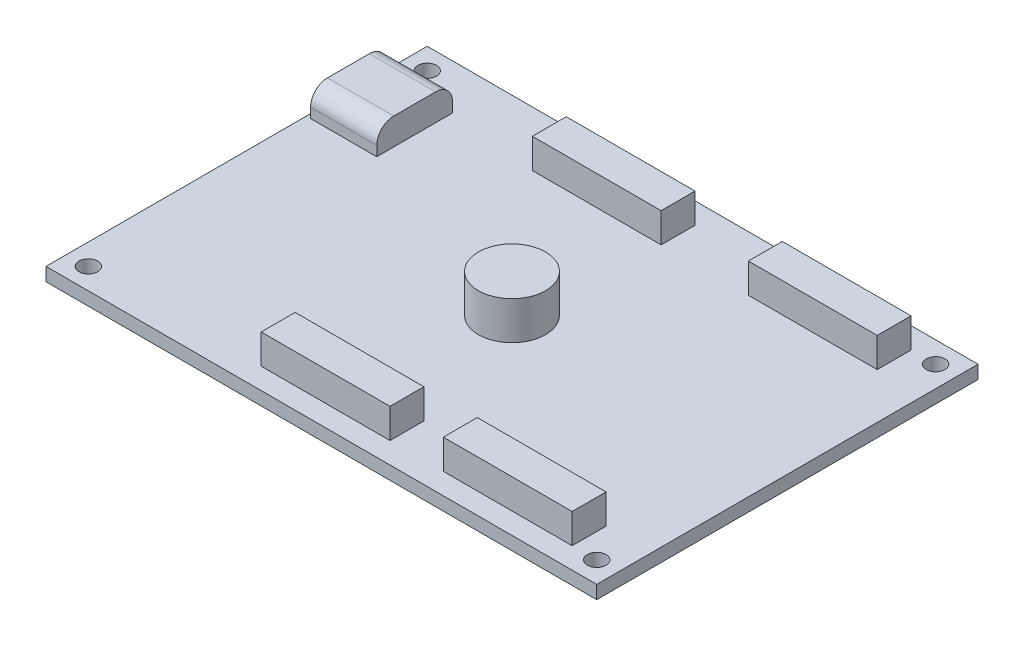
ISO-10303-21;
HEADER;
FILE_DESCRIPTION(('STEP AP214'),'2;1');
FILE_NAME('part.step','',(''),(''),'','','');
FILE_SCHEMA(('AUTOMOTIVE_DESIGN { 1 0 10303 214 1 1 1 1 }'));
ENDSEC;
DATA;
#1=APPLICATION_CONTEXT('core data for automotive mechanical design processes');
#2=APPLICATION_PROTOCOL_DEFINITION('international standard','automotive_design',2000,#1);
#3=PRODUCT_CONTEXT('',#1,'mechanical');
#4=PRODUCT('Part','Part','',(#3));
#5=PRODUCT_RELATED_PRODUCT_CATEGORY('part','',(#4));
#6=PRODUCT_DEFINITION_FORMATION('','',#4);
#7=PRODUCT_DEFINITION_CONTEXT('part definition',#1,'design');
#8=PRODUCT_DEFINITION('design','',#6,#7);
#9=PRODUCT_DEFINITION_SHAPE('','',#8);
#10=(LENGTH_UNIT() NAMED_UNIT(*) SI_UNIT(.MILLI.,.METRE.));
#11=(NAMED_UNIT(*) PLANE_ANGLE_UNIT() SI_UNIT($,.RADIAN.));
#12=(NAMED_UNIT(*) SI_UNIT($,.STERADIAN.) SOLID_ANGLE_UNIT());
#13=UNCERTAINTY_MEASURE_WITH_UNIT(LENGTH_MEASURE(1.E-05),#10,'distance_accuracy_value','');
#14=(GEOMETRIC_REPRESENTATION_CONTEXT(3) GLOBAL_UNCERTAINTY_ASSIGNED_CONTEXT((#13)) GLOBAL_UNIT_ASSIGNED_CONTEXT((#10,
#11,#12)) REPRESENTATION_CONTEXT('',''));
#15=CARTESIAN_POINT('',(0.,0.,0.));
#16=DIRECTION('',(0.,0.,1.));
#17=DIRECTION('',(1.,0.,0.));
#18=AXIS2_PLACEMENT_3D('',#15,#16,#17);
#19=CARTESIAN_POINT('',(0.,0.,0.));
#20=DIRECTION('',(0.,1.,0.));
#21=DIRECTION('',(0.,0.,1.));
#22=AXIS2_PLACEMENT_3D('',#19,#20,#21);
#23=PLANE('',#22);
#24=CARTESIAN_POINT('',(0.,0.,0.));
#25=DIRECTION('',(0.,1.,0.));
#26=DIRECTION('',(0.,0.,1.));
#27=AXIS2_PLACEMENT_3D('',#24,#25,#26);
#28=CIRCLE('',#27,3.96204769980138);
#29=CARTESIAN_POINT('',(0.,0.,3.96204769980138));
#30=VERTEX_POINT('',#29);
#31=EDGE_CURVE('E443',#30,#30,#28,.T.);
#32=ORIENTED_EDGE('',*,*,#31,.F.);
#33=EDGE_LOOP('',(#32));
#34=FACE_BOUND('',#33,.T.);
#35=DIRECTION('',(0.,0.,1.));
#36=VECTOR('',#35,1.);
#37=CARTESIAN_POINT('',(27.1,0.,0.));
#38=LINE('',#37,#36);
#39=CARTESIAN_POINT('',(27.1,0.,16.));
#40=VERTEX_POINT('',#39);
#41=CARTESIAN_POINT('',(27.1,0.,20.));
#42=VERTEX_POINT('',#41);
#43=EDGE_CURVE('E271',#40,#42,#38,.T.);
#44=ORIENTED_EDGE('',*,*,#43,.T.);
#45=DIRECTION('',(1.,0.,0.));
#46=VECTOR('',#45,1.);
#47=CARTESIAN_POINT('',(0.,0.,20.));
#48=LINE('',#47,#46);
#49=CARTESIAN_POINT('',(11.9,0.,20.));
#50=VERTEX_POINT('',#49);
#51=EDGE_CURVE('E276',#50,#42,#48,.T.);
#52=ORIENTED_EDGE('',*,*,#51,.F.);
#53=DIRECTION('',(0.,0.,1.));
#54=VECTOR('',#53,1.);
#55=CARTESIAN_POINT('',(11.9,0.,0.));
#56=LINE('',#55,#54);
#57=CARTESIAN_POINT('',(11.9,0.,16.));
#58=VERTEX_POINT('',#57);
#59=EDGE_CURVE('E289',#58,#50,#56,.T.);
#60=ORIENTED_EDGE('',*,*,#59,.F.);
#61=DIRECTION('',(1.,0.,0.));
#62=VECTOR('',#61,1.);
#63=CARTESIAN_POINT('',(0.,0.,16.));
#64=LINE('',#63,#62);
#65=EDGE_CURVE('E286',#58,#40,#64,.T.);
#66=ORIENTED_EDGE('',*,*,#65,.T.);
#67=EDGE_LOOP('',(#44,#52,#60,#66));
#68=FACE_BOUND('',#67,.T.);
#69=DIRECTION('',(0.,0.,1.));
#70=VECTOR('',#69,1.);
#71=CARTESIAN_POINT('',(27.1,0.,0.));
#72=LINE('',#71,#70);
#73=CARTESIAN_POINT('',(27.1,0.,-20.));
#74=VERTEX_POINT('',#73);
#75=CARTESIAN_POINT('',(27.1,0.,-16.));
#76=VERTEX_POINT('',#75);
#77=EDGE_CURVE('E301',#74,#76,#72,.T.);
#78=ORIENTED_EDGE('',*,*,#77,.T.);
#79=DIRECTION('',(1.,0.,0.));
#80=VECTOR('',#79,1.);
#81=CARTESIAN_POINT('',(0.,0.,-16.));
#82=LINE('',#81,#80);
#83=CARTESIAN_POINT('',(11.9,0.,-16.));
#84=VERTEX_POINT('',#83);
#85=EDGE_CURVE('E306',#84,#76,#82,.T.);
#86=ORIENTED_EDGE('',*,*,#85,.F.);
#87=DIRECTION('',(0.,0.,1.));
#88=VECTOR('',#87,1.);
#89=CARTESIAN_POINT('',(11.9,0.,0.));
#90=LINE('',#89,#88);
#91=CARTESIAN_POINT('',(11.9,0.,-20.));
#92=VERTEX_POINT('',#91);
#93=EDGE_CURVE('E319',#92,#84,#90,.T.);
#94=ORIENTED_EDGE('',*,*,#93,.F.);
#95=DIRECTION('',(1.,0.,0.));
#96=VECTOR('',#95,1.);
#97=CARTESIAN_POINT('',(0.,0.,-20.));
#98=LINE('',#97,#96);
#99=EDGE_CURVE('E316',#92,#74,#98,.T.);
#100=ORIENTED_EDGE('',*,*,#99,.T.);
#101=EDGE_LOOP('',(#78,#86,#94,#100));
#102=FACE_BOUND('',#101,.T.);
#103=DIRECTION('',(0.,0.,1.));
#104=VECTOR('',#103,1.);
#105=CARTESIAN_POINT('',(1.60000000000001,0.,0.));
#106=LINE('',#105,#104);
#107=CARTESIAN_POINT('',(1.60000000000001,0.,-20.));
#108=VERTEX_POINT('',#107);
#109=CARTESIAN_POINT('',(1.60000000000001,0.,-16.));
#110=VERTEX_POINT('',#109);
#111=EDGE_CURVE('E331',#108,#110,#106,.T.);
#112=ORIENTED_EDGE('',*,*,#111,.T.);
#113=DIRECTION('',(1.,0.,0.));
#114=VECTOR('',#113,1.);
#115=CARTESIAN_POINT('',(0.,0.,-16.));
#116=LINE('',#115,#114);
#117=CARTESIAN_POINT('',(-13.6,0.,-16.));
#118=VERTEX_POINT('',#117);
#119=EDGE_CURVE('E336',#118,#110,#116,.T.);
#120=ORIENTED_EDGE('',*,*,#119,.F.);
#121=DIRECTION('',(0.,0.,1.));
#122=VECTOR('',#121,1.);
#123=CARTESIAN_POINT('',(-13.6,0.,0.));
#124=LINE('',#123,#122);
#125=CARTESIAN_POINT('',(-13.6,0.,-20.));
#126=VERTEX_POINT('',#125);
#127=EDGE_CURVE('E349',#126,#118,#124,.T.);
#128=ORIENTED_EDGE('',*,*,#127,.F.);
#129=DIRECTION('',(1.,0.,0.));
#130=VECTOR('',#129,1.);
#131=CARTESIAN_POINT('',(0.,0.,-20.));
#132=LINE('',#131,#130);
#133=EDGE_CURVE('E346',#126,#108,#132,.T.);
#134=ORIENTED_EDGE('',*,*,#133,.T.);
#135=EDGE_LOOP('',(#112,#120,#128,#134));
#136=FACE_BOUND('',#135,.T.);
#137=DIRECTION('',(0.,0.,1.));
#138=VECTOR('',#137,1.);
#139=CARTESIAN_POINT('',(5.6,0.,0.));
#140=LINE('',#139,#138);
#141=CARTESIAN_POINT('',(5.60000000000001,0.,16.));
#142=VERTEX_POINT('',#141);
#143=CARTESIAN_POINT('',(5.60000000000002,0.,20.));
#144=VERTEX_POINT('',#143);
#145=EDGE_CURVE('E361',#142,#144,#140,.T.);
#146=ORIENTED_EDGE('',*,*,#145,.T.);
#147=DIRECTION('',(1.,0.,0.));
#148=VECTOR('',#147,1.);
#149=CARTESIAN_POINT('',(0.,0.,20.));
#150=LINE('',#149,#148);
#151=CARTESIAN_POINT('',(-9.59999999999998,0.,20.0000000000001));
#152=VERTEX_POINT('',#151);
#153=EDGE_CURVE('E366',#152,#144,#150,.T.);
#154=ORIENTED_EDGE('',*,*,#153,.F.);
#155=DIRECTION('',(0.,0.,1.));
#156=VECTOR('',#155,1.);
#157=CARTESIAN_POINT('',(-9.6,0.,0.));
#158=LINE('',#157,#156);
#159=CARTESIAN_POINT('',(-9.59999999999998,0.,16.));
#160=VERTEX_POINT('',#159);
#161=EDGE_CURVE('E379',#160,#152,#158,.T.);
#162=ORIENTED_EDGE('',*,*,#161,.F.);
#163=DIRECTION('',(1.,0.,0.));
#164=VECTOR('',#163,1.);
#165=CARTESIAN_POINT('',(0.,0.,16.));
#166=LINE('',#165,#164);
#167=EDGE_CURVE('E376',#160,#142,#166,.T.);
#168=ORIENTED_EDGE('',*,*,#167,.T.);
#169=EDGE_LOOP('',(#146,#154,#162,#168));
#170=FACE_BOUND('',#169,.T.);
#171=CARTESIAN_POINT('',(30.,0.,20.));
#172=DIRECTION('',(0.,1.,0.));
#173=DIRECTION('',(0.,0.,1.));
#174=AXIS2_PLACEMENT_3D('',#171,#172,#173);
#175=CIRCLE('',#174,1.1);
#176=CARTESIAN_POINT('',(30.,0.,21.1));
#177=VERTEX_POINT('',#176);
#178=EDGE_CURVE('E391',#177,#177,#175,.T.);
#179=ORIENTED_EDGE('',*,*,#178,.F.);
#180=EDGE_LOOP('',(#179));
#181=FACE_BOUND('',#180,.T.);
#182=CARTESIAN_POINT('',(30.,0.,-20.));
#183=DIRECTION('',(0.,1.,0.));
#184=DIRECTION('',(0.,0.,1.));
#185=AXIS2_PLACEMENT_3D('',#182,#183,#184);
#186=CIRCLE('',#185,1.1);
#187=CARTESIAN_POINT('',(30.,0.,-18.9));
#188=VERTEX_POINT('',#187);
#189=EDGE_CURVE('E420',#188,#188,#186,.T.);
#190=ORIENTED_EDGE('',*,*,#189,.F.);
#191=EDGE_LOOP('',(#190));
#192=FACE_BOUND('',#191,.T.);
#193=CARTESIAN_POINT('',(-30.,0.,-20.));
#194=DIRECTION('',(0.,1.,0.));
#195=DIRECTION('',(0.,0.,1.));
#196=AXIS2_PLACEMENT_3D('',#193,#194,#195);
#197=CIRCLE('',#196,1.1);
#198=CARTESIAN_POINT('',(-30.,0.,-18.9));
#199=VERTEX_POINT('',#198);
#200=EDGE_CURVE('E423',#199,#199,#197,.T.);
#201=ORIENTED_EDGE('',*,*,#200,.F.);
#202=EDGE_LOOP('',(#201));
#203=FACE_BOUND('',#202,.T.);
#204=CARTESIAN_POINT('',(-30.,0.,20.));
#205=DIRECTION('',(0.,1.,0.));
#206=DIRECTION('',(0.,0.,1.));
#207=AXIS2_PLACEMENT_3D('',#204,#205,#206);
#208=CIRCLE('',#207,1.1);
#209=CARTESIAN_POINT('',(-30.,0.,21.1));
#210=VERTEX_POINT('',#209);
#211=EDGE_CURVE('E426',#210,#210,#208,.T.);
#212=ORIENTED_EDGE('',*,*,#211,.F.);
#213=EDGE_LOOP('',(#212));
#214=FACE_BOUND('',#213,.T.);
#215=DIRECTION('',(0.,0.,-1.));
#216=VECTOR('',#215,1.);
#217=CARTESIAN_POINT('',(-32.5,0.,0.));
#218=LINE('',#217,#216);
#219=CARTESIAN_POINT('',(-32.5,0.,22.5));
#220=VERTEX_POINT('',#219);
#221=CARTESIAN_POINT('',(-32.5,0.,-22.5));
#222=VERTEX_POINT('',#221);
#223=EDGE_CURVE('E429',#220,#222,#218,.T.);
#224=ORIENTED_EDGE('',*,*,#223,.F.);
#225=DIRECTION('',(-1.,0.,0.));
#226=VECTOR('',#225,1.);
#227=CARTESIAN_POINT('',(0.,0.,22.5));
#228=LINE('',#227,#226);
#229=CARTESIAN_POINT('',(32.5,0.,22.5));
#230=VERTEX_POINT('',#229);
#231=EDGE_CURVE('E433',#230,#220,#228,.T.);
#232=ORIENTED_EDGE('',*,*,#231,.F.);
#233=DIRECTION('',(0.,0.,-1.));
#234=VECTOR('',#233,1.);
#235=CARTESIAN_POINT('',(32.5,0.,0.));
#236=LINE('',#235,#234);
#237=CARTESIAN_POINT('',(32.5,0.,-22.5));
#238=VERTEX_POINT('',#237);
#239=EDGE_CURVE('E435',#230,#238,#236,.T.);
#240=ORIENTED_EDGE('',*,*,#239,.T.);
#241=DIRECTION('',(-1.,0.,0.));
#242=VECTOR('',#241,1.);
#243=CARTESIAN_POINT('',(0.,0.,-22.5));
#244=LINE('',#243,#242);
#245=EDGE_CURVE('E396',#238,#222,#244,.T.);
#246=ORIENTED_EDGE('',*,*,#245,.T.);
#247=EDGE_LOOP('',(#224,#232,#240,#246));
#248=FACE_BOUND('',#247,.T.);
#249=DIRECTION('',(1.,0.,0.));
#250=VECTOR('',#249,1.);
#251=CARTESIAN_POINT('',(-32.,0.,-8.23000129));
#252=LINE('',#251,#250);
#253=CARTESIAN_POINT('',(-32.,0.,-8.23000129));
#254=VERTEX_POINT('',#253);
#255=CARTESIAN_POINT('',(-24.19,0.,-8.23000129));
#256=VERTEX_POINT('',#255);
#257=EDGE_CURVE('E225',#254,#256,#252,.T.);
#258=ORIENTED_EDGE('',*,*,#257,.F.);
#259=DIRECTION('',(0.,0.,1.));
#260=VECTOR('',#259,1.);
#261=CARTESIAN_POINT('',(-32.,0.,-17.17000129));
#262=LINE('',#261,#260);
#263=CARTESIAN_POINT('',(-32.,0.,-17.17000129));
#264=VERTEX_POINT('',#263);
#265=EDGE_CURVE('E235',#264,#254,#262,.T.);
#266=ORIENTED_EDGE('',*,*,#265,.F.);
#267=DIRECTION('',(-1.,0.,0.));
#268=VECTOR('',#267,1.);
#269=CARTESIAN_POINT('',(-32.,0.,-17.17000129));
#270=LINE('',#269,#268);
#271=CARTESIAN_POINT('',(-24.19,0.,-17.17000129));
#272=VERTEX_POINT('',#271);
#273=EDGE_CURVE('E249',#272,#264,#270,.T.);
#274=ORIENTED_EDGE('',*,*,#273,.F.);
#275=DIRECTION('',(0.,0.,-1.));
#276=VECTOR('',#275,1.);
#277=CARTESIAN_POINT('',(-24.19,0.,-17.17000129));
#278=LINE('',#277,#276);
#279=EDGE_CURVE('E245',#256,#272,#278,.T.);
#280=ORIENTED_EDGE('',*,*,#279,.F.);
#281=EDGE_LOOP('',(#258,#266,#274,#280));
#282=FACE_BOUND('',#281,.T.);
#283=ADVANCED_FACE('F41',(#34,#68,#102,#136,#170,#181,#192,#203,#214,#248,#282),#23,.T.);
#284=CARTESIAN_POINT('',(-32.5,-1.57,0.));
#285=DIRECTION('',(1.,0.,0.));
#286=DIRECTION('',(0.,0.,-1.));
#287=AXIS2_PLACEMENT_3D('',#284,#285,#286);
#288=PLANE('',#287);
#289=ORIENTED_EDGE('',*,*,#223,.T.);
#290=DIRECTION('',(0.,1.,0.));
#291=VECTOR('',#290,1.);
#292=CARTESIAN_POINT('',(-32.5,-1.57,-22.5));
#293=LINE('',#292,#291);
#294=CARTESIAN_POINT('',(-32.5,-1.57,-22.5));
#295=VERTEX_POINT('',#294);
#296=EDGE_CURVE('E441',#295,#222,#293,.T.);
#297=ORIENTED_EDGE('',*,*,#296,.F.);
#298=DIRECTION('',(0.,0.,-1.));
#299=VECTOR('',#298,1.);
#300=CARTESIAN_POINT('',(-32.5,-1.57,0.));
#301=LINE('',#300,#299);
#302=CARTESIAN_POINT('',(-32.5,-1.57,22.5));
#303=VERTEX_POINT('',#302);
#304=EDGE_CURVE('E405',#303,#295,#301,.T.);
#305=ORIENTED_EDGE('',*,*,#304,.F.);
#306=DIRECTION('',(0.,1.,0.));
#307=VECTOR('',#306,1.);
#308=CARTESIAN_POINT('',(-32.5,-1.57,22.5));
#309=LINE('',#308,#307);
#310=EDGE_CURVE('E417',#303,#220,#309,.T.);
#311=ORIENTED_EDGE('',*,*,#310,.T.);
#312=EDGE_LOOP('',(#289,#297,#305,#311));
#313=FACE_BOUND('',#312,.T.);
#314=ADVANCED_FACE('F485',(#313),#288,.F.);
#315=CARTESIAN_POINT('',(0.,-1.57,-22.5));
#316=DIRECTION('',(0.,0.,-1.));
#317=DIRECTION('',(-1.,0.,0.));
#318=AXIS2_PLACEMENT_3D('',#315,#316,#317);
#319=PLANE('',#318);
#320=ORIENTED_EDGE('',*,*,#245,.F.);
#321=DIRECTION('',(0.,1.,0.));
#322=VECTOR('',#321,1.);
#323=CARTESIAN_POINT('',(32.5,-1.57,-22.5));
#324=LINE('',#323,#322);
#325=CARTESIAN_POINT('',(32.5,-1.57,-22.5));
#326=VERTEX_POINT('',#325);
#327=EDGE_CURVE('E444',#326,#238,#324,.T.);
#328=ORIENTED_EDGE('',*,*,#327,.F.);
#329=DIRECTION('',(-1.,0.,0.));
#330=VECTOR('',#329,1.);
#331=CARTESIAN_POINT('',(0.,-1.57,-22.5));
#332=LINE('',#331,#330);
#333=EDGE_CURVE('E413',#326,#295,#332,.T.);
#334=ORIENTED_EDGE('',*,*,#333,.T.);
#335=ORIENTED_EDGE('',*,*,#296,.T.);
#336=EDGE_LOOP('',(#320,#328,#334,#335));
#337=FACE_BOUND('',#336,.T.);
#338=ADVANCED_FACE('F491',(#337),#319,.T.);
#339=CARTESIAN_POINT('',(32.5,-1.57,0.));
#340=DIRECTION('',(1.,0.,0.));
#341=DIRECTION('',(0.,0.,-1.));
#342=AXIS2_PLACEMENT_3D('',#339,#340,#341);
#343=PLANE('',#342);
#344=ORIENTED_EDGE('',*,*,#239,.F.);
#345=DIRECTION('',(0.,1.,0.));
#346=VECTOR('',#345,1.);
#347=CARTESIAN_POINT('',(32.5,-1.57,22.5));
#348=LINE('',#347,#346);
#349=CARTESIAN_POINT('',(32.5,-1.57,22.5));
#350=VERTEX_POINT('',#349);
#351=EDGE_CURVE('E446',#350,#230,#348,.T.);
#352=ORIENTED_EDGE('',*,*,#351,.F.);
#353=DIRECTION('',(0.,0.,-1.));
#354=VECTOR('',#353,1.);
#355=CARTESIAN_POINT('',(32.5,-1.57,0.));
#356=LINE('',#355,#354);
#357=EDGE_CURVE('E410',#350,#326,#356,.T.);
#358=ORIENTED_EDGE('',*,*,#357,.T.);
#359=ORIENTED_EDGE('',*,*,#327,.T.);
#360=EDGE_LOOP('',(#344,#352,#358,#359));
#361=FACE_BOUND('',#360,.T.);
#362=ADVANCED_FACE('F502',(#361),#343,.T.);
#363=CARTESIAN_POINT('',(-30.,-1.57,20.));
#364=DIRECTION('',(0.,1.,0.));
#365=DIRECTION('',(0.,0.,1.));
#366=AXIS2_PLACEMENT_3D('',#363,#364,#365);
#367=CYLINDRICAL_SURFACE('',#366,1.1);
#368=CARTESIAN_POINT('',(-30.,-1.57,20.));
#369=DIRECTION('',(0.,1.,0.));
#370=DIRECTION('',(0.,0.,1.));
#371=AXIS2_PLACEMENT_3D('',#368,#369,#370);
#372=CIRCLE('',#371,1.1);
#373=CARTESIAN_POINT('',(-30.,-1.57,21.1));
#374=VERTEX_POINT('',#373);
#375=EDGE_CURVE('E402',#374,#374,#372,.T.);
#376=ORIENTED_EDGE('',*,*,#375,.F.);
#377=EDGE_LOOP('',(#376));
#378=FACE_BOUND('',#377,.T.);
#379=ORIENTED_EDGE('',*,*,#211,.T.);
#380=EDGE_LOOP('',(#379));
#381=FACE_BOUND('',#380,.T.);
#382=ADVANCED_FACE('F506',(#378,#381),#367,.F.);
#383=CARTESIAN_POINT('',(-30.,-1.57,-20.));
#384=DIRECTION('',(0.,1.,0.));
#385=DIRECTION('',(0.,0.,1.));
#386=AXIS2_PLACEMENT_3D('',#383,#384,#385);
#387=CYLINDRICAL_SURFACE('',#386,1.1);
#388=CARTESIAN_POINT('',(-30.,-1.57,-20.));
#389=DIRECTION('',(0.,1.,0.));
#390=DIRECTION('',(0.,0.,1.));
#391=AXIS2_PLACEMENT_3D('',#388,#389,#390);
#392=CIRCLE('',#391,1.1);
#393=CARTESIAN_POINT('',(-30.,-1.57,-18.9));
#394=VERTEX_POINT('',#393);
#395=EDGE_CURVE('E399',#394,#394,#392,.T.);
#396=ORIENTED_EDGE('',*,*,#395,.F.);
#397=EDGE_LOOP('',(#396));
#398=FACE_BOUND('',#397,.T.);
#399=ORIENTED_EDGE('',*,*,#200,.T.);
#400=EDGE_LOOP('',(#399));
#401=FACE_BOUND('',#400,.T.);
#402=ADVANCED_FACE('F515',(#398,#401),#387,.F.);
#403=CARTESIAN_POINT('',(30.,-1.57,-20.));
#404=DIRECTION('',(0.,1.,0.));
#405=DIRECTION('',(0.,0.,1.));
#406=AXIS2_PLACEMENT_3D('',#403,#404,#405);
#407=CYLINDRICAL_SURFACE('',#406,1.1);
#408=CARTESIAN_POINT('',(30.,-1.57,-20.));
#409=DIRECTION('',(0.,1.,0.));
#410=DIRECTION('',(0.,0.,1.));
#411=AXIS2_PLACEMENT_3D('',#408,#409,#410);
#412=CIRCLE('',#411,1.1);
#413=CARTESIAN_POINT('',(30.,-1.57,-18.9));
#414=VERTEX_POINT('',#413);
#415=EDGE_CURVE('E395',#414,#414,#412,.T.);
#416=ORIENTED_EDGE('',*,*,#415,.F.);
#417=EDGE_LOOP('',(#416));
#418=FACE_BOUND('',#417,.T.);
#419=ORIENTED_EDGE('',*,*,#189,.T.);
#420=EDGE_LOOP('',(#419));
#421=FACE_BOUND('',#420,.T.);
#422=ADVANCED_FACE('F519',(#418,#421),#407,.F.);
#423=CARTESIAN_POINT('',(30.,-1.57,20.));
#424=DIRECTION('',(0.,1.,0.));
#425=DIRECTION('',(0.,0.,1.));
#426=AXIS2_PLACEMENT_3D('',#423,#424,#425);
#427=CYLINDRICAL_SURFACE('',#426,1.1);
#428=CARTESIAN_POINT('',(30.,-1.57,20.));
#429=DIRECTION('',(0.,1.,0.));
#430=DIRECTION('',(0.,0.,1.));
#431=AXIS2_PLACEMENT_3D('',#428,#429,#430);
#432=CIRCLE('',#431,1.1);
#433=CARTESIAN_POINT('',(30.,-1.57,21.1));
#434=VERTEX_POINT('',#433);
#435=EDGE_CURVE('E392',#434,#434,#432,.T.);
#436=ORIENTED_EDGE('',*,*,#435,.F.);
#437=EDGE_LOOP('',(#436));
#438=FACE_BOUND('',#437,.T.);
#439=ORIENTED_EDGE('',*,*,#178,.T.);
#440=EDGE_LOOP('',(#439));
#441=FACE_BOUND('',#440,.T.);
#442=ADVANCED_FACE('F510',(#438,#441),#427,.F.);
#443=CARTESIAN_POINT('',(0.,-1.57,22.5));
#444=DIRECTION('',(0.,0.,-1.));
#445=DIRECTION('',(-1.,0.,0.));
#446=AXIS2_PLACEMENT_3D('',#443,#444,#445);
#447=PLANE('',#446);
#448=ORIENTED_EDGE('',*,*,#231,.T.);
#449=ORIENTED_EDGE('',*,*,#310,.F.);
#450=DIRECTION('',(-1.,0.,0.));
#451=VECTOR('',#450,1.);
#452=CARTESIAN_POINT('',(0.,-1.57,22.5));
#453=LINE('',#452,#451);
#454=EDGE_CURVE('E408',#350,#303,#453,.T.);
#455=ORIENTED_EDGE('',*,*,#454,.F.);
#456=ORIENTED_EDGE('',*,*,#351,.T.);
#457=EDGE_LOOP('',(#448,#449,#455,#456));
#458=FACE_BOUND('',#457,.T.);
#459=ADVANCED_FACE('F508',(#458),#447,.F.);
#460=CARTESIAN_POINT('',(0.,-1.57,0.));
#461=DIRECTION('',(0.,1.,0.));
#462=DIRECTION('',(0.,0.,1.));
#463=AXIS2_PLACEMENT_3D('',#460,#461,#462);
#464=PLANE('',#463);
#465=CARTESIAN_POINT('',(0.,-1.57,0.));
#466=DIRECTION('',(0.,1.,0.));
#467=DIRECTION('',(0.,0.,1.));
#468=AXIS2_PLACEMENT_3D('',#465,#466,#467);
#469=CIRCLE('',#468,3.96204769980138);
#470=CARTESIAN_POINT('',(0.,-1.57,3.96204769980138));
#471=VERTEX_POINT('',#470);
#472=EDGE_CURVE('E268',#471,#471,#469,.T.);
#473=ORIENTED_EDGE('',*,*,#472,.T.);
#474=EDGE_LOOP('',(#473));
#475=FACE_BOUND('',#474,.T.);
#476=ORIENTED_EDGE('',*,*,#435,.T.);
#477=EDGE_LOOP('',(#476));
#478=FACE_BOUND('',#477,.T.);
#479=ORIENTED_EDGE('',*,*,#415,.T.);
#480=EDGE_LOOP('',(#479));
#481=FACE_BOUND('',#480,.T.);
#482=ORIENTED_EDGE('',*,*,#395,.T.);
#483=EDGE_LOOP('',(#482));
#484=FACE_BOUND('',#483,.T.);
#485=ORIENTED_EDGE('',*,*,#375,.T.);
#486=EDGE_LOOP('',(#485));
#487=FACE_BOUND('',#486,.T.);
#488=ORIENTED_EDGE('',*,*,#304,.T.);
#489=ORIENTED_EDGE('',*,*,#333,.F.);
#490=ORIENTED_EDGE('',*,*,#357,.F.);
#491=ORIENTED_EDGE('',*,*,#454,.T.);
#492=EDGE_LOOP('',(#488,#489,#490,#491));
#493=FACE_BOUND('',#492,.T.);
#494=ADVANCED_FACE('F498',(#475,#478,#481,#484,#487,#493),#464,.F.);
#495=CARTESIAN_POINT('',(5.6,3.5,0.));
#496=DIRECTION('',(1.,0.,0.));
#497=DIRECTION('',(0.,0.,-1.));
#498=AXIS2_PLACEMENT_3D('',#495,#496,#497);
#499=PLANE('',#498);
#500=ORIENTED_EDGE('',*,*,#145,.F.);
#501=DIRECTION('',(0.,-1.,0.));
#502=VECTOR('',#501,1.);
#503=CARTESIAN_POINT('',(5.60000000000001,3.5,16.));
#504=LINE('',#503,#502);
#505=CARTESIAN_POINT('',(5.60000000000001,3.5,16.));
#506=VERTEX_POINT('',#505);
#507=EDGE_CURVE('E389',#506,#142,#504,.T.);
#508=ORIENTED_EDGE('',*,*,#507,.F.);
#509=DIRECTION('',(0.,0.,1.));
#510=VECTOR('',#509,1.);
#511=CARTESIAN_POINT('',(5.6,3.5,0.));
#512=LINE('',#511,#510);
#513=CARTESIAN_POINT('',(5.60000000000002,3.5,20.));
#514=VERTEX_POINT('',#513);
#515=EDGE_CURVE('E362',#506,#514,#512,.T.);
#516=ORIENTED_EDGE('',*,*,#515,.T.);
#517=DIRECTION('',(0.,-1.,0.));
#518=VECTOR('',#517,1.);
#519=CARTESIAN_POINT('',(5.60000000000002,3.5,20.));
#520=LINE('',#519,#518);
#521=EDGE_CURVE('E373',#514,#144,#520,.T.);
#522=ORIENTED_EDGE('',*,*,#521,.T.);
#523=EDGE_LOOP('',(#500,#508,#516,#522));
#524=FACE_BOUND('',#523,.T.);
#525=ADVANCED_FACE('F551',(#524),#499,.T.);
#526=CARTESIAN_POINT('',(0.,3.5,16.));
#527=DIRECTION('',(0.,0.,-1.));
#528=DIRECTION('',(-1.,0.,0.));
#529=AXIS2_PLACEMENT_3D('',#526,#527,#528);
#530=PLANE('',#529);
#531=ORIENTED_EDGE('',*,*,#167,.F.);
#532=DIRECTION('',(0.,-1.,0.));
#533=VECTOR('',#532,1.);
#534=CARTESIAN_POINT('',(-9.59999999999998,3.5,16.));
#535=LINE('',#534,#533);
#536=CARTESIAN_POINT('',(-9.59999999999998,3.5,16.));
#537=VERTEX_POINT('',#536);
#538=EDGE_CURVE('E387',#537,#160,#535,.T.);
#539=ORIENTED_EDGE('',*,*,#538,.F.);
#540=DIRECTION('',(1.,0.,0.));
#541=VECTOR('',#540,1.);
#542=CARTESIAN_POINT('',(0.,3.5,16.));
#543=LINE('',#542,#541);
#544=EDGE_CURVE('E365',#537,#506,#543,.T.);
#545=ORIENTED_EDGE('',*,*,#544,.T.);
#546=ORIENTED_EDGE('',*,*,#507,.T.);
#547=EDGE_LOOP('',(#531,#539,#545,#546));
#548=FACE_BOUND('',#547,.T.);
#549=ADVANCED_FACE('F556',(#548),#530,.T.);
#550=CARTESIAN_POINT('',(-9.6,3.5,0.));
#551=DIRECTION('',(1.,0.,0.));
#552=DIRECTION('',(0.,0.,-1.));
#553=AXIS2_PLACEMENT_3D('',#550,#551,#552);
#554=PLANE('',#553);
#555=ORIENTED_EDGE('',*,*,#161,.T.);
#556=DIRECTION('',(0.,-1.,0.));
#557=VECTOR('',#556,1.);
#558=CARTESIAN_POINT('',(-9.59999999999998,3.5,20.0000000000001));
#559=LINE('',#558,#557);
#560=CARTESIAN_POINT('',(-9.59999999999998,3.5,20.0000000000001));
#561=VERTEX_POINT('',#560);
#562=EDGE_CURVE('E385',#561,#152,#559,.T.);
#563=ORIENTED_EDGE('',*,*,#562,.F.);
#564=DIRECTION('',(0.,0.,1.));
#565=VECTOR('',#564,1.);
#566=CARTESIAN_POINT('',(-9.6,3.5,0.));
#567=LINE('',#566,#565);
#568=EDGE_CURVE('E369',#537,#561,#567,.T.);
#569=ORIENTED_EDGE('',*,*,#568,.F.);
#570=ORIENTED_EDGE('',*,*,#538,.T.);
#571=EDGE_LOOP('',(#555,#563,#569,#570));
#572=FACE_BOUND('',#571,.T.);
#573=ADVANCED_FACE('F653',(#572),#554,.F.);
#574=CARTESIAN_POINT('',(0.,3.5,20.));
#575=DIRECTION('',(0.,0.,-1.));
#576=DIRECTION('',(-1.,0.,0.));
#577=AXIS2_PLACEMENT_3D('',#574,#575,#576);
#578=PLANE('',#577);
#579=ORIENTED_EDGE('',*,*,#153,.T.);
#580=ORIENTED_EDGE('',*,*,#521,.F.);
#581=DIRECTION('',(1.,0.,0.));
#582=VECTOR('',#581,1.);
#583=CARTESIAN_POINT('',(0.,3.5,20.));
#584=LINE('',#583,#582);
#585=EDGE_CURVE('E371',#561,#514,#584,.T.);
#586=ORIENTED_EDGE('',*,*,#585,.F.);
#587=ORIENTED_EDGE('',*,*,#562,.T.);
#588=EDGE_LOOP('',(#579,#580,#586,#587));
#589=FACE_BOUND('',#588,.T.);
#590=ADVANCED_FACE('F649',(#589),#578,.F.);
#591=CARTESIAN_POINT('',(0.,3.5,0.));
#592=DIRECTION('',(0.,1.,0.));
#593=DIRECTION('',(0.,0.,1.));
#594=AXIS2_PLACEMENT_3D('',#591,#592,#593);
#595=PLANE('',#594);
#596=ORIENTED_EDGE('',*,*,#515,.F.);
#597=ORIENTED_EDGE('',*,*,#544,.F.);
#598=ORIENTED_EDGE('',*,*,#568,.T.);
#599=ORIENTED_EDGE('',*,*,#585,.T.);
#600=EDGE_LOOP('',(#596,#597,#598,#599));
#601=FACE_BOUND('',#600,.T.);
#602=ADVANCED_FACE('F645',(#601),#595,.T.);
#603=CARTESIAN_POINT('',(1.60000000000001,3.5,0.));
#604=DIRECTION('',(1.,0.,0.));
#605=DIRECTION('',(0.,0.,-1.));
#606=AXIS2_PLACEMENT_3D('',#603,#604,#605);
#607=PLANE('',#606);
#608=ORIENTED_EDGE('',*,*,#111,.F.);
#609=DIRECTION('',(0.,-1.,0.));
#610=VECTOR('',#609,1.);
#611=CARTESIAN_POINT('',(1.60000000000001,3.5,-20.));
#612=LINE('',#611,#610);
#613=CARTESIAN_POINT('',(1.60000000000001,3.5,-20.));
#614=VERTEX_POINT('',#613);
#615=EDGE_CURVE('E359',#614,#108,#612,.T.);
#616=ORIENTED_EDGE('',*,*,#615,.F.);
#617=DIRECTION('',(0.,0.,1.));
#618=VECTOR('',#617,1.);
#619=CARTESIAN_POINT('',(1.60000000000001,3.5,0.));
#620=LINE('',#619,#618);
#621=CARTESIAN_POINT('',(1.60000000000001,3.5,-16.));
#622=VERTEX_POINT('',#621);
#623=EDGE_CURVE('E332',#614,#622,#620,.T.);
#624=ORIENTED_EDGE('',*,*,#623,.T.);
#625=DIRECTION('',(0.,-1.,0.));
#626=VECTOR('',#625,1.);
#627=CARTESIAN_POINT('',(1.60000000000001,3.5,-16.));
#628=LINE('',#627,#626);
#629=EDGE_CURVE('E343',#622,#110,#628,.T.);
#630=ORIENTED_EDGE('',*,*,#629,.T.);
#631=EDGE_LOOP('',(#608,#616,#624,#630));
#632=FACE_BOUND('',#631,.T.);
#633=ADVANCED_FACE('F641',(#632),#607,.T.);
#634=CARTESIAN_POINT('',(0.,3.5,-20.));
#635=DIRECTION('',(0.,0.,-1.));
#636=DIRECTION('',(-1.,0.,0.));
#637=AXIS2_PLACEMENT_3D('',#634,#635,#636);
#638=PLANE('',#637);
#639=ORIENTED_EDGE('',*,*,#133,.F.);
#640=DIRECTION('',(0.,-1.,0.));
#641=VECTOR('',#640,1.);
#642=CARTESIAN_POINT('',(-13.6,3.5,-20.));
#643=LINE('',#642,#641);
#644=CARTESIAN_POINT('',(-13.6,3.5,-20.));
#645=VERTEX_POINT('',#644);
#646=EDGE_CURVE('E357',#645,#126,#643,.T.);
#647=ORIENTED_EDGE('',*,*,#646,.F.);
#648=DIRECTION('',(1.,0.,0.));
#649=VECTOR('',#648,1.);
#650=CARTESIAN_POINT('',(0.,3.5,-20.));
#651=LINE('',#650,#649);
#652=EDGE_CURVE('E335',#645,#614,#651,.T.);
#653=ORIENTED_EDGE('',*,*,#652,.T.);
#654=ORIENTED_EDGE('',*,*,#615,.T.);
#655=EDGE_LOOP('',(#639,#647,#653,#654));
#656=FACE_BOUND('',#655,.T.);
#657=ADVANCED_FACE('F637',(#656),#638,.T.);
#658=CARTESIAN_POINT('',(-13.6,3.5,0.));
#659=DIRECTION('',(1.,0.,0.));
#660=DIRECTION('',(0.,0.,-1.));
#661=AXIS2_PLACEMENT_3D('',#658,#659,#660);
#662=PLANE('',#661);
#663=ORIENTED_EDGE('',*,*,#127,.T.);
#664=DIRECTION('',(0.,-1.,0.));
#665=VECTOR('',#664,1.);
#666=CARTESIAN_POINT('',(-13.6,3.5,-16.));
#667=LINE('',#666,#665);
#668=CARTESIAN_POINT('',(-13.6,3.5,-16.));
#669=VERTEX_POINT('',#668);
#670=EDGE_CURVE('E355',#669,#118,#667,.T.);
#671=ORIENTED_EDGE('',*,*,#670,.F.);
#672=DIRECTION('',(0.,0.,1.));
#673=VECTOR('',#672,1.);
#674=CARTESIAN_POINT('',(-13.6,3.5,0.));
#675=LINE('',#674,#673);
#676=EDGE_CURVE('E339',#645,#669,#675,.T.);
#677=ORIENTED_EDGE('',*,*,#676,.F.);
#678=ORIENTED_EDGE('',*,*,#646,.T.);
#679=EDGE_LOOP('',(#663,#671,#677,#678));
#680=FACE_BOUND('',#679,.T.);
#681=ADVANCED_FACE('F633',(#680),#662,.F.);
#682=CARTESIAN_POINT('',(0.,3.5,-16.));
#683=DIRECTION('',(0.,0.,-1.));
#684=DIRECTION('',(-1.,0.,0.));
#685=AXIS2_PLACEMENT_3D('',#682,#683,#684);
#686=PLANE('',#685);
#687=ORIENTED_EDGE('',*,*,#119,.T.);
#688=ORIENTED_EDGE('',*,*,#629,.F.);
#689=DIRECTION('',(1.,0.,0.));
#690=VECTOR('',#689,1.);
#691=CARTESIAN_POINT('',(0.,3.5,-16.));
#692=LINE('',#691,#690);
#693=EDGE_CURVE('E341',#669,#622,#692,.T.);
#694=ORIENTED_EDGE('',*,*,#693,.F.);
#695=ORIENTED_EDGE('',*,*,#670,.T.);
#696=EDGE_LOOP('',(#687,#688,#694,#695));
#697=FACE_BOUND('',#696,.T.);
#698=ADVANCED_FACE('F629',(#697),#686,.F.);
#699=CARTESIAN_POINT('',(0.,3.5,0.));
#700=DIRECTION('',(0.,1.,0.));
#701=DIRECTION('',(0.,0.,1.));
#702=AXIS2_PLACEMENT_3D('',#699,#700,#701);
#703=PLANE('',#702);
#704=ORIENTED_EDGE('',*,*,#623,.F.);
#705=ORIENTED_EDGE('',*,*,#652,.F.);
#706=ORIENTED_EDGE('',*,*,#676,.T.);
#707=ORIENTED_EDGE('',*,*,#693,.T.);
#708=EDGE_LOOP('',(#704,#705,#706,#707));
#709=FACE_BOUND('',#708,.T.);
#710=ADVANCED_FACE('F625',(#709),#703,.T.);
#711=CARTESIAN_POINT('',(27.1,3.5,0.));
#712=DIRECTION('',(1.,0.,0.));
#713=DIRECTION('',(0.,0.,-1.));
#714=AXIS2_PLACEMENT_3D('',#711,#712,#713);
#715=PLANE('',#714);
#716=ORIENTED_EDGE('',*,*,#77,.F.);
#717=DIRECTION('',(0.,-1.,0.));
#718=VECTOR('',#717,1.);
#719=CARTESIAN_POINT('',(27.1,3.5,-20.));
#720=LINE('',#719,#718);
#721=CARTESIAN_POINT('',(27.1,3.5,-20.));
#722=VERTEX_POINT('',#721);
#723=EDGE_CURVE('E329',#722,#74,#720,.T.);
#724=ORIENTED_EDGE('',*,*,#723,.F.);
#725=DIRECTION('',(0.,0.,1.));
#726=VECTOR('',#725,1.);
#727=CARTESIAN_POINT('',(27.1,3.5,0.));
#728=LINE('',#727,#726);
#729=CARTESIAN_POINT('',(27.1,3.5,-16.));
#730=VERTEX_POINT('',#729);
#731=EDGE_CURVE('E302',#722,#730,#728,.T.);
#732=ORIENTED_EDGE('',*,*,#731,.T.);
#733=DIRECTION('',(0.,-1.,0.));
#734=VECTOR('',#733,1.);
#735=CARTESIAN_POINT('',(27.1,3.5,-16.));
#736=LINE('',#735,#734);
#737=EDGE_CURVE('E313',#730,#76,#736,.T.);
#738=ORIENTED_EDGE('',*,*,#737,.T.);
#739=EDGE_LOOP('',(#716,#724,#732,#738));
#740=FACE_BOUND('',#739,.T.);
#741=ADVANCED_FACE('F621',(#740),#715,.T.);
#742=CARTESIAN_POINT('',(0.,3.5,-20.));
#743=DIRECTION('',(0.,0.,-1.));
#744=DIRECTION('',(-1.,0.,0.));
#745=AXIS2_PLACEMENT_3D('',#742,#743,#744);
#746=PLANE('',#745);
#747=ORIENTED_EDGE('',*,*,#99,.F.);
#748=DIRECTION('',(0.,-1.,0.));
#749=VECTOR('',#748,1.);
#750=CARTESIAN_POINT('',(11.9,3.5,-20.));
#751=LINE('',#750,#749);
#752=CARTESIAN_POINT('',(11.9,3.5,-20.));
#753=VERTEX_POINT('',#752);
#754=EDGE_CURVE('E327',#753,#92,#751,.T.);
#755=ORIENTED_EDGE('',*,*,#754,.F.);
#756=DIRECTION('',(1.,0.,0.));
#757=VECTOR('',#756,1.);
#758=CARTESIAN_POINT('',(0.,3.5,-20.));
#759=LINE('',#758,#757);
#760=EDGE_CURVE('E305',#753,#722,#759,.T.);
#761=ORIENTED_EDGE('',*,*,#760,.T.);
#762=ORIENTED_EDGE('',*,*,#723,.T.);
#763=EDGE_LOOP('',(#747,#755,#761,#762));
#764=FACE_BOUND('',#763,.T.);
#765=ADVANCED_FACE('F617',(#764),#746,.T.);
#766=CARTESIAN_POINT('',(11.9,3.5,0.));
#767=DIRECTION('',(1.,0.,0.));
#768=DIRECTION('',(0.,0.,-1.));
#769=AXIS2_PLACEMENT_3D('',#766,#767,#768);
#770=PLANE('',#769);
#771=ORIENTED_EDGE('',*,*,#93,.T.);
#772=DIRECTION('',(0.,-1.,0.));
#773=VECTOR('',#772,1.);
#774=CARTESIAN_POINT('',(11.9,3.5,-16.));
#775=LINE('',#774,#773);
#776=CARTESIAN_POINT('',(11.9,3.5,-16.));
#777=VERTEX_POINT('',#776);
#778=EDGE_CURVE('E325',#777,#84,#775,.T.);
#779=ORIENTED_EDGE('',*,*,#778,.F.);
#780=DIRECTION('',(0.,0.,1.));
#781=VECTOR('',#780,1.);
#782=CARTESIAN_POINT('',(11.9,3.5,0.));
#783=LINE('',#782,#781);
#784=EDGE_CURVE('E309',#753,#777,#783,.T.);
#785=ORIENTED_EDGE('',*,*,#784,.F.);
#786=ORIENTED_EDGE('',*,*,#754,.T.);
#787=EDGE_LOOP('',(#771,#779,#785,#786));
#788=FACE_BOUND('',#787,.T.);
#789=ADVANCED_FACE('F613',(#788),#770,.F.);
#790=CARTESIAN_POINT('',(0.,3.5,-16.));
#791=DIRECTION('',(0.,0.,-1.));
#792=DIRECTION('',(-1.,0.,0.));
#793=AXIS2_PLACEMENT_3D('',#790,#791,#792);
#794=PLANE('',#793);
#795=ORIENTED_EDGE('',*,*,#85,.T.);
#796=ORIENTED_EDGE('',*,*,#737,.F.);
#797=DIRECTION('',(1.,0.,0.));
#798=VECTOR('',#797,1.);
#799=CARTESIAN_POINT('',(0.,3.5,-16.));
#800=LINE('',#799,#798);
#801=EDGE_CURVE('E311',#777,#730,#800,.T.);
#802=ORIENTED_EDGE('',*,*,#801,.F.);
#803=ORIENTED_EDGE('',*,*,#778,.T.);
#804=EDGE_LOOP('',(#795,#796,#802,#803));
#805=FACE_BOUND('',#804,.T.);
#806=ADVANCED_FACE('F609',(#805),#794,.F.);
#807=CARTESIAN_POINT('',(0.,3.5,0.));
#808=DIRECTION('',(0.,1.,0.));
#809=DIRECTION('',(0.,0.,1.));
#810=AXIS2_PLACEMENT_3D('',#807,#808,#809);
#811=PLANE('',#810);
#812=ORIENTED_EDGE('',*,*,#731,.F.);
#813=ORIENTED_EDGE('',*,*,#760,.F.);
#814=ORIENTED_EDGE('',*,*,#784,.T.);
#815=ORIENTED_EDGE('',*,*,#801,.T.);
#816=EDGE_LOOP('',(#812,#813,#814,#815));
#817=FACE_BOUND('',#816,.T.);
#818=ADVANCED_FACE('F605',(#817),#811,.T.);
#819=CARTESIAN_POINT('',(27.1,3.5,0.));
#820=DIRECTION('',(1.,0.,0.));
#821=DIRECTION('',(0.,0.,-1.));
#822=AXIS2_PLACEMENT_3D('',#819,#820,#821);
#823=PLANE('',#822);
#824=ORIENTED_EDGE('',*,*,#43,.F.);
#825=DIRECTION('',(0.,-1.,0.));
#826=VECTOR('',#825,1.);
#827=CARTESIAN_POINT('',(27.1,3.5,16.));
#828=LINE('',#827,#826);
#829=CARTESIAN_POINT('',(27.1,3.5,16.));
#830=VERTEX_POINT('',#829);
#831=EDGE_CURVE('E299',#830,#40,#828,.T.);
#832=ORIENTED_EDGE('',*,*,#831,.F.);
#833=DIRECTION('',(0.,0.,1.));
#834=VECTOR('',#833,1.);
#835=CARTESIAN_POINT('',(27.1,3.5,0.));
#836=LINE('',#835,#834);
#837=CARTESIAN_POINT('',(27.1,3.5,20.));
#838=VERTEX_POINT('',#837);
#839=EDGE_CURVE('E272',#830,#838,#836,.T.);
#840=ORIENTED_EDGE('',*,*,#839,.T.);
#841=DIRECTION('',(0.,-1.,0.));
#842=VECTOR('',#841,1.);
#843=CARTESIAN_POINT('',(27.1,3.5,20.));
#844=LINE('',#843,#842);
#845=EDGE_CURVE('E283',#838,#42,#844,.T.);
#846=ORIENTED_EDGE('',*,*,#845,.T.);
#847=EDGE_LOOP('',(#824,#832,#840,#846));
#848=FACE_BOUND('',#847,.T.);
#849=ADVANCED_FACE('F601',(#848),#823,.T.);
#850=CARTESIAN_POINT('',(0.,3.5,16.));
#851=DIRECTION('',(0.,0.,-1.));
#852=DIRECTION('',(-1.,0.,0.));
#853=AXIS2_PLACEMENT_3D('',#850,#851,#852);
#854=PLANE('',#853);
#855=ORIENTED_EDGE('',*,*,#65,.F.);
#856=DIRECTION('',(0.,-1.,0.));
#857=VECTOR('',#856,1.);
#858=CARTESIAN_POINT('',(11.9,3.5,16.));
#859=LINE('',#858,#857);
#860=CARTESIAN_POINT('',(11.9,3.5,16.));
#861=VERTEX_POINT('',#860);
#862=EDGE_CURVE('E297',#861,#58,#859,.T.);
#863=ORIENTED_EDGE('',*,*,#862,.F.);
#864=DIRECTION('',(1.,0.,0.));
#865=VECTOR('',#864,1.);
#866=CARTESIAN_POINT('',(0.,3.5,16.));
#867=LINE('',#866,#865);
#868=EDGE_CURVE('E275',#861,#830,#867,.T.);
#869=ORIENTED_EDGE('',*,*,#868,.T.);
#870=ORIENTED_EDGE('',*,*,#831,.T.);
#871=EDGE_LOOP('',(#855,#863,#869,#870));
#872=FACE_BOUND('',#871,.T.);
#873=ADVANCED_FACE('F597',(#872),#854,.T.);
#874=CARTESIAN_POINT('',(11.9,3.5,0.));
#875=DIRECTION('',(1.,0.,0.));
#876=DIRECTION('',(0.,0.,-1.));
#877=AXIS2_PLACEMENT_3D('',#874,#875,#876);
#878=PLANE('',#877);
#879=ORIENTED_EDGE('',*,*,#59,.T.);
#880=DIRECTION('',(0.,-1.,0.));
#881=VECTOR('',#880,1.);
#882=CARTESIAN_POINT('',(11.9,3.5,20.));
#883=LINE('',#882,#881);
#884=CARTESIAN_POINT('',(11.9,3.5,20.));
#885=VERTEX_POINT('',#884);
#886=EDGE_CURVE('E295',#885,#50,#883,.T.);
#887=ORIENTED_EDGE('',*,*,#886,.F.);
#888=DIRECTION('',(0.,0.,1.));
#889=VECTOR('',#888,1.);
#890=CARTESIAN_POINT('',(11.9,3.5,0.));
#891=LINE('',#890,#889);
#892=EDGE_CURVE('E279',#861,#885,#891,.T.);
#893=ORIENTED_EDGE('',*,*,#892,.F.);
#894=ORIENTED_EDGE('',*,*,#862,.T.);
#895=EDGE_LOOP('',(#879,#887,#893,#894));
#896=FACE_BOUND('',#895,.T.);
#897=ADVANCED_FACE('F593',(#896),#878,.F.);
#898=CARTESIAN_POINT('',(0.,3.5,20.));
#899=DIRECTION('',(0.,0.,-1.));
#900=DIRECTION('',(-1.,0.,0.));
#901=AXIS2_PLACEMENT_3D('',#898,#899,#900);
#902=PLANE('',#901);
#903=ORIENTED_EDGE('',*,*,#51,.T.);
#904=ORIENTED_EDGE('',*,*,#845,.F.);
#905=DIRECTION('',(1.,0.,0.));
#906=VECTOR('',#905,1.);
#907=CARTESIAN_POINT('',(0.,3.5,20.));
#908=LINE('',#907,#906);
#909=EDGE_CURVE('E281',#885,#838,#908,.T.);
#910=ORIENTED_EDGE('',*,*,#909,.F.);
#911=ORIENTED_EDGE('',*,*,#886,.T.);
#912=EDGE_LOOP('',(#903,#904,#910,#911));
#913=FACE_BOUND('',#912,.T.);
#914=ADVANCED_FACE('F589',(#913),#902,.F.);
#915=CARTESIAN_POINT('',(0.,3.5,0.));
#916=DIRECTION('',(0.,1.,0.));
#917=DIRECTION('',(0.,0.,1.));
#918=AXIS2_PLACEMENT_3D('',#915,#916,#917);
#919=PLANE('',#918);
#920=ORIENTED_EDGE('',*,*,#839,.F.);
#921=ORIENTED_EDGE('',*,*,#868,.F.);
#922=ORIENTED_EDGE('',*,*,#892,.T.);
#923=ORIENTED_EDGE('',*,*,#909,.T.);
#924=EDGE_LOOP('',(#920,#921,#922,#923));
#925=FACE_BOUND('',#924,.T.);
#926=ADVANCED_FACE('F586',(#925),#919,.T.);
#927=CARTESIAN_POINT('',(0.,4.5,0.));
#928=DIRECTION('',(0.,1.,0.));
#929=DIRECTION('',(0.,0.,1.));
#930=AXIS2_PLACEMENT_3D('',#927,#928,#929);
#931=PLANE('',#930);
#932=CARTESIAN_POINT('',(0.,4.5,0.));
#933=DIRECTION('',(0.,1.,0.));
#934=DIRECTION('',(0.,0.,1.));
#935=AXIS2_PLACEMENT_3D('',#932,#933,#934);
#936=CIRCLE('',#935,3.96204769980138);
#937=CARTESIAN_POINT('',(0.,4.5,3.96204769980138));
#938=VERTEX_POINT('',#937);
#939=EDGE_CURVE('E231',#938,#938,#936,.T.);
#940=ORIENTED_EDGE('',*,*,#939,.T.);
#941=EDGE_LOOP('',(#940));
#942=FACE_BOUND('',#941,.T.);
#943=ADVANCED_FACE('F582',(#942),#931,.T.);
#944=CARTESIAN_POINT('',(0.,-3.97,0.));
#945=DIRECTION('',(0.,1.,0.));
#946=DIRECTION('',(0.,0.,1.));
#947=AXIS2_PLACEMENT_3D('',#944,#945,#946);
#948=CYLINDRICAL_SURFACE('',#947,3.96204769980138);
#949=ORIENTED_EDGE('',*,*,#31,.T.);
#950=EDGE_LOOP('',(#949));
#951=FACE_BOUND('',#950,.T.);
#952=ORIENTED_EDGE('',*,*,#939,.F.);
#953=EDGE_LOOP('',(#952));
#954=FACE_BOUND('',#953,.T.);
#955=ADVANCED_FACE('F573',(#951,#954),#948,.T.);
#956=CARTESIAN_POINT('',(0.,-3.97,0.));
#957=DIRECTION('',(0.,1.,0.));
#958=DIRECTION('',(0.,0.,1.));
#959=AXIS2_PLACEMENT_3D('',#956,#957,#958);
#960=CIRCLE('',#959,3.96204769980138);
#961=CARTESIAN_POINT('',(0.,-3.97,3.96204769980138));
#962=VERTEX_POINT('',#961);
#963=EDGE_CURVE('E265',#962,#962,#960,.T.);
#964=ORIENTED_EDGE('',*,*,#963,.T.);
#965=EDGE_LOOP('',(#964));
#966=FACE_BOUND('',#965,.T.);
#967=ORIENTED_EDGE('',*,*,#472,.F.);
#968=EDGE_LOOP('',(#967));
#969=FACE_BOUND('',#968,.T.);
#970=ADVANCED_FACE('F570',(#966,#969),#948,.T.);
#971=CARTESIAN_POINT('',(0.,-3.97,0.));
#972=DIRECTION('',(0.,1.,0.));
#973=DIRECTION('',(0.,0.,1.));
#974=AXIS2_PLACEMENT_3D('',#971,#972,#973);
#975=PLANE('',#974);
#976=ORIENTED_EDGE('',*,*,#963,.F.);
#977=EDGE_LOOP('',(#976));
#978=FACE_BOUND('',#977,.T.);
#979=ADVANCED_FACE('F572',(#978),#975,.F.);
#980=CARTESIAN_POINT('',(-32.,3.16,-17.17000129));
#981=DIRECTION('',(1.,0.,0.));
#982=DIRECTION('',(0.,0.,-1.));
#983=AXIS2_PLACEMENT_3D('',#980,#981,#982);
#984=PLANE('',#983);
#985=DIRECTION('',(0.,0.,1.));
#986=VECTOR('',#985,1.);
#987=CARTESIAN_POINT('',(-32.,3.16,-17.17000129));
#988=LINE('',#987,#986);
#989=CARTESIAN_POINT('',(-32.,3.16,-15.17000129));
#990=VERTEX_POINT('',#989);
#991=CARTESIAN_POINT('',(-32.,3.16,-10.23000129));
#992=VERTEX_POINT('',#991);
#993=EDGE_CURVE('E255',#990,#992,#988,.T.);
#994=ORIENTED_EDGE('',*,*,#993,.F.);
#995=CARTESIAN_POINT('',(-32.,1.16,-15.17000129));
#996=DIRECTION('',(1.,0.,0.));
#997=DIRECTION('',(0.,0.,-1.));
#998=AXIS2_PLACEMENT_3D('',#995,#996,#997);
#999=CIRCLE('',#998,2.);
#1000=CARTESIAN_POINT('',(-32.,1.16,-17.17000129));
#1001=VERTEX_POINT('',#1000);
#1002=EDGE_CURVE('E462',#990,#1001,#999,.F.);
#1003=ORIENTED_EDGE('',*,*,#1002,.T.);
#1004=DIRECTION('',(0.,-1.,0.));
#1005=VECTOR('',#1004,1.);
#1006=CARTESIAN_POINT('',(-32.,3.16,-17.17000129));
#1007=LINE('',#1006,#1005);
#1008=EDGE_CURVE('E238',#1001,#264,#1007,.T.);
#1009=ORIENTED_EDGE('',*,*,#1008,.T.);
#1010=ORIENTED_EDGE('',*,*,#265,.T.);
#1011=DIRECTION('',(0.,-1.,0.));
#1012=VECTOR('',#1011,1.);
#1013=CARTESIAN_POINT('',(-32.,3.16,-8.23000129));
#1014=LINE('',#1013,#1012);
#1015=CARTESIAN_POINT('',(-32.,1.16,-8.23000129));
#1016=VERTEX_POINT('',#1015);
#1017=EDGE_CURVE('E221',#1016,#254,#1014,.T.);
#1018=ORIENTED_EDGE('',*,*,#1017,.F.);
#1019=CARTESIAN_POINT('',(-32.,1.16,-10.23000129));
#1020=DIRECTION('',(1.,0.,0.));
#1021=DIRECTION('',(0.,0.,-1.));
#1022=AXIS2_PLACEMENT_3D('',#1019,#1020,#1021);
#1023=CIRCLE('',#1022,2.);
#1024=EDGE_CURVE('E459',#1016,#992,#1023,.F.);
#1025=ORIENTED_EDGE('',*,*,#1024,.T.);
#1026=EDGE_LOOP('',(#994,#1003,#1009,#1010,#1018,#1025));
#1027=FACE_BOUND('',#1026,.T.);
#1028=ADVANCED_FACE('F237',(#1027),#984,.F.);
#1029=CARTESIAN_POINT('',(-32.,3.16,-8.23000129));
#1030=DIRECTION('',(0.,0.,-1.));
#1031=DIRECTION('',(-1.,0.,0.));
#1032=AXIS2_PLACEMENT_3D('',#1029,#1030,#1031);
#1033=PLANE('',#1032);
#1034=DIRECTION('',(0.,-1.,0.));
#1035=VECTOR('',#1034,1.);
#1036=CARTESIAN_POINT('',(-24.19,3.16,-8.23000129));
#1037=LINE('',#1036,#1035);
#1038=CARTESIAN_POINT('',(-24.19,1.16,-8.23000129));
#1039=VERTEX_POINT('',#1038);
#1040=EDGE_CURVE('E232',#1039,#256,#1037,.T.);
#1041=ORIENTED_EDGE('',*,*,#1040,.F.);
#1042=DIRECTION('',(1.,0.,0.));
#1043=VECTOR('',#1042,1.);
#1044=CARTESIAN_POINT('',(-32.,1.16,-8.23000129));
#1045=LINE('',#1044,#1043);
#1046=EDGE_CURVE('E11',#1039,#1016,#1045,.F.);
#1047=ORIENTED_EDGE('',*,*,#1046,.T.);
#1048=ORIENTED_EDGE('',*,*,#1017,.T.);
#1049=ORIENTED_EDGE('',*,*,#257,.T.);
#1050=EDGE_LOOP('',(#1041,#1047,#1048,#1049));
#1051=FACE_BOUND('',#1050,.T.);
#1052=ADVANCED_FACE('F223',(#1051),#1033,.F.);
#1053=CARTESIAN_POINT('',(-24.19,3.16,-17.17000129));
#1054=DIRECTION('',(-1.,0.,0.));
#1055=DIRECTION('',(0.,0.,1.));
#1056=AXIS2_PLACEMENT_3D('',#1053,#1054,#1055);
#1057=PLANE('',#1056);
#1058=DIRECTION('',(0.,-1.,0.));
#1059=VECTOR('',#1058,1.);
#1060=CARTESIAN_POINT('',(-24.19,3.16,-17.17000129));
#1061=LINE('',#1060,#1059);
#1062=CARTESIAN_POINT('',(-24.19,1.16,-17.17000129));
#1063=VERTEX_POINT('',#1062);
#1064=EDGE_CURVE('E258',#1063,#272,#1061,.T.);
#1065=ORIENTED_EDGE('',*,*,#1064,.F.);
#1066=CARTESIAN_POINT('',(-24.19,1.16,-15.17000129));
#1067=DIRECTION('',(-1.,0.,0.));
#1068=DIRECTION('',(0.,0.,1.));
#1069=AXIS2_PLACEMENT_3D('',#1066,#1067,#1068);
#1070=CIRCLE('',#1069,2.);
#1071=CARTESIAN_POINT('',(-24.19,3.16,-15.17000129));
#1072=VERTEX_POINT('',#1071);
#1073=EDGE_CURVE('E50',#1063,#1072,#1070,.F.);
#1074=ORIENTED_EDGE('',*,*,#1073,.T.);
#1075=DIRECTION('',(0.,0.,-1.));
#1076=VECTOR('',#1075,1.);
#1077=CARTESIAN_POINT('',(-24.19,3.16,-17.17000129));
#1078=LINE('',#1077,#1076);
#1079=CARTESIAN_POINT('',(-24.19,3.16,-10.23000129));
#1080=VERTEX_POINT('',#1079);
#1081=EDGE_CURVE('E259',#1080,#1072,#1078,.T.);
#1082=ORIENTED_EDGE('',*,*,#1081,.F.);
#1083=CARTESIAN_POINT('',(-24.19,1.16,-10.23000129));
#1084=DIRECTION('',(-1.,0.,0.));
#1085=DIRECTION('',(0.,0.,1.));
#1086=AXIS2_PLACEMENT_3D('',#1083,#1084,#1085);
#1087=CIRCLE('',#1086,2.);
#1088=EDGE_CURVE('E60',#1080,#1039,#1087,.F.);
#1089=ORIENTED_EDGE('',*,*,#1088,.T.);
#1090=ORIENTED_EDGE('',*,*,#1040,.T.);
#1091=ORIENTED_EDGE('',*,*,#279,.T.);
#1092=EDGE_LOOP('',(#1065,#1074,#1082,#1089,#1090,#1091));
#1093=FACE_BOUND('',#1092,.T.);
#1094=ADVANCED_FACE('F468',(#1093),#1057,.F.);
#1095=CARTESIAN_POINT('',(-32.,3.16,-17.17000129));
#1096=DIRECTION('',(0.,0.,1.));
#1097=DIRECTION('',(1.,0.,0.));
#1098=AXIS2_PLACEMENT_3D('',#1095,#1096,#1097);
#1099=PLANE('',#1098);
#1100=ORIENTED_EDGE('',*,*,#1008,.F.);
#1101=DIRECTION('',(-1.,0.,0.));
#1102=VECTOR('',#1101,1.);
#1103=CARTESIAN_POINT('',(-24.19,1.16,-17.17000129));
#1104=LINE('',#1103,#1102);
#1105=EDGE_CURVE('E68',#1001,#1063,#1104,.F.);
#1106=ORIENTED_EDGE('',*,*,#1105,.T.);
#1107=ORIENTED_EDGE('',*,*,#1064,.T.);
#1108=ORIENTED_EDGE('',*,*,#273,.T.);
#1109=EDGE_LOOP('',(#1100,#1106,#1107,#1108));
#1110=FACE_BOUND('',#1109,.T.);
#1111=ADVANCED_FACE('F476',(#1110),#1099,.F.);
#1112=CARTESIAN_POINT('',(0.,3.16,0.));
#1113=DIRECTION('',(0.,1.,0.));
#1114=DIRECTION('',(0.,0.,1.));
#1115=AXIS2_PLACEMENT_3D('',#1112,#1113,#1114);
#1116=PLANE('',#1115);
#1117=ORIENTED_EDGE('',*,*,#1081,.T.);
#1118=DIRECTION('',(-1.,0.,0.));
#1119=VECTOR('',#1118,1.);
#1120=CARTESIAN_POINT('',(-32.,3.16,-15.17000129));
#1121=LINE('',#1120,#1119);
#1122=EDGE_CURVE('E456',#1072,#990,#1121,.T.);
#1123=ORIENTED_EDGE('',*,*,#1122,.T.);
#1124=ORIENTED_EDGE('',*,*,#993,.T.);
#1125=DIRECTION('',(1.,0.,0.));
#1126=VECTOR('',#1125,1.);
#1127=CARTESIAN_POINT('',(-24.19,3.16,-10.23000129));
#1128=LINE('',#1127,#1126);
#1129=EDGE_CURVE('E452',#992,#1080,#1128,.T.);
#1130=ORIENTED_EDGE('',*,*,#1129,.T.);
#1131=EDGE_LOOP('',(#1117,#1123,#1124,#1130));
#1132=FACE_BOUND('',#1131,.T.);
#1133=ADVANCED_FACE('F472',(#1132),#1116,.T.);
#1134=CARTESIAN_POINT('',(0.,1.16,-15.17000129));
#1135=DIRECTION('',(1.,0.,0.));
#1136=DIRECTION('',(0.,0.,-1.));
#1137=AXIS2_PLACEMENT_3D('',#1134,#1135,#1136);
#1138=CYLINDRICAL_SURFACE('',#1137,2.);
#1139=ORIENTED_EDGE('',*,*,#1073,.F.);
#1140=ORIENTED_EDGE('',*,*,#1105,.F.);
#1141=ORIENTED_EDGE('',*,*,#1002,.F.);
#1142=ORIENTED_EDGE('',*,*,#1122,.F.);
#1143=EDGE_LOOP('',(#1139,#1140,#1141,#1142));
#1144=FACE_BOUND('',#1143,.T.);
#1145=ADVANCED_FACE('F475',(#1144),#1138,.T.);
#1146=CARTESIAN_POINT('',(0.,1.16,-10.23000129));
#1147=DIRECTION('',(-1.,0.,0.));
#1148=DIRECTION('',(0.,0.,1.));
#1149=AXIS2_PLACEMENT_3D('',#1146,#1147,#1148);
#1150=CYLINDRICAL_SURFACE('',#1149,2.);
#1151=ORIENTED_EDGE('',*,*,#1024,.F.);
#1152=ORIENTED_EDGE('',*,*,#1046,.F.);
#1153=ORIENTED_EDGE('',*,*,#1088,.F.);
#1154=ORIENTED_EDGE('',*,*,#1129,.F.);
#1155=EDGE_LOOP('',(#1151,#1152,#1153,#1154));
#1156=FACE_BOUND('',#1155,.T.);
#1157=ADVANCED_FACE('F43',(#1156),#1150,.T.);
#1158=CLOSED_SHELL('',(#283,#314,#338,#362,#382,#402,#422,#442,#459,#494,#525,#549,#573,#590,
#602,#633,#657,#681,#698,#710,#741,#765,#789,#806,#818,#849,#873,#897,#914,#926,#943,#955,#970,
#979,#1028,#1052,#1094,#1111,#1133,#1145,#1157));
#1159=MANIFOLD_SOLID_BREP('B2',#1158);
#1160=ADVANCED_BREP_SHAPE_REPRESENTATION('',(#18,#1159),#14);
#1161=SHAPE_DEFINITION_REPRESENTATION(#9,#1160);
ENDSEC;
END-ISO-10303-21;
